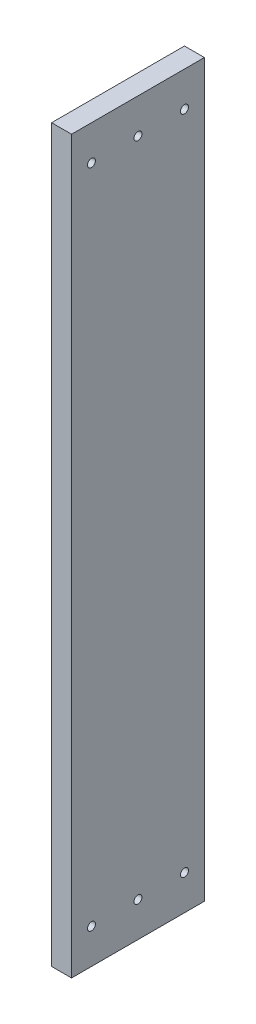
ISO-10303-21;
HEADER;
FILE_DESCRIPTION(('STEP AP214'),'2;1');
FILE_NAME('part.step','',(''),(''),'','','');
FILE_SCHEMA(('AUTOMOTIVE_DESIGN { 1 0 10303 214 1 1 1 1 }'));
ENDSEC;
DATA;
#1=APPLICATION_CONTEXT('core data for automotive mechanical design processes');
#2=APPLICATION_PROTOCOL_DEFINITION('international standard','automotive_design',2000,#1);
#3=PRODUCT_CONTEXT('',#1,'mechanical');
#4=PRODUCT('Part','Part','',(#3));
#5=PRODUCT_RELATED_PRODUCT_CATEGORY('part','',(#4));
#6=PRODUCT_DEFINITION_FORMATION('','',#4);
#7=PRODUCT_DEFINITION_CONTEXT('part definition',#1,'design');
#8=PRODUCT_DEFINITION('design','',#6,#7);
#9=PRODUCT_DEFINITION_SHAPE('','',#8);
#10=(LENGTH_UNIT() NAMED_UNIT(*) SI_UNIT(.MILLI.,.METRE.));
#11=(NAMED_UNIT(*) PLANE_ANGLE_UNIT() SI_UNIT($,.RADIAN.));
#12=(NAMED_UNIT(*) SI_UNIT($,.STERADIAN.) SOLID_ANGLE_UNIT());
#13=UNCERTAINTY_MEASURE_WITH_UNIT(LENGTH_MEASURE(1.E-05),#10,'distance_accuracy_value','');
#14=(GEOMETRIC_REPRESENTATION_CONTEXT(3) GLOBAL_UNCERTAINTY_ASSIGNED_CONTEXT((#13)) GLOBAL_UNIT_ASSIGNED_CONTEXT((#10,
#11,#12)) REPRESENTATION_CONTEXT('',''));
#15=CARTESIAN_POINT('',(0.,0.,0.));
#16=DIRECTION('',(0.,0.,1.));
#17=DIRECTION('',(1.,0.,0.));
#18=AXIS2_PLACEMENT_3D('',#15,#16,#17);
#19=CARTESIAN_POINT('',(0.,698.5,0.));
#20=DIRECTION('',(1.,0.,0.));
#21=DIRECTION('',(0.,0.,-1.));
#22=AXIS2_PLACEMENT_3D('',#19,#20,#21);
#23=PLANE('',#22);
#24=CARTESIAN_POINT('',(0.,33.274,-107.95));
#25=DIRECTION('',(1.,0.,0.));
#26=DIRECTION('',(0.,0.,-1.));
#27=AXIS2_PLACEMENT_3D('',#24,#25,#26);
#28=CIRCLE('',#27,3.81000000000002);
#29=CARTESIAN_POINT('',(0.,33.274,-111.76));
#30=VERTEX_POINT('',#29);
#31=EDGE_CURVE('E98',#30,#30,#28,.T.);
#32=ORIENTED_EDGE('',*,*,#31,.T.);
#33=EDGE_LOOP('',(#32));
#34=FACE_BOUND('',#33,.T.);
#35=CARTESIAN_POINT('',(0.,33.274,-63.5000000000001));
#36=DIRECTION('',(1.,0.,0.));
#37=DIRECTION('',(0.,0.,-1.));
#38=AXIS2_PLACEMENT_3D('',#35,#36,#37);
#39=CIRCLE('',#38,3.81000000000003);
#40=CARTESIAN_POINT('',(0.,33.274,-67.3100000000001));
#41=VERTEX_POINT('',#40);
#42=EDGE_CURVE('E111',#41,#41,#39,.T.);
#43=ORIENTED_EDGE('',*,*,#42,.T.);
#44=EDGE_LOOP('',(#43));
#45=FACE_BOUND('',#44,.T.);
#46=CARTESIAN_POINT('',(0.,33.274,-19.0500000000001));
#47=DIRECTION('',(1.,0.,0.));
#48=DIRECTION('',(0.,0.,-1.));
#49=AXIS2_PLACEMENT_3D('',#46,#47,#48);
#50=CIRCLE('',#49,3.81000000000003);
#51=CARTESIAN_POINT('',(0.,33.274,-22.8600000000001));
#52=VERTEX_POINT('',#51);
#53=EDGE_CURVE('E114',#52,#52,#50,.T.);
#54=ORIENTED_EDGE('',*,*,#53,.T.);
#55=EDGE_LOOP('',(#54));
#56=FACE_BOUND('',#55,.T.);
#57=CARTESIAN_POINT('',(0.,665.226,-19.05));
#58=DIRECTION('',(1.,0.,0.));
#59=DIRECTION('',(0.,0.,-1.));
#60=AXIS2_PLACEMENT_3D('',#57,#58,#59);
#61=CIRCLE('',#60,3.8100000000001);
#62=CARTESIAN_POINT('',(0.,665.226,-22.8600000000001));
#63=VERTEX_POINT('',#62);
#64=EDGE_CURVE('E117',#63,#63,#61,.T.);
#65=ORIENTED_EDGE('',*,*,#64,.T.);
#66=EDGE_LOOP('',(#65));
#67=FACE_BOUND('',#66,.T.);
#68=CARTESIAN_POINT('',(0.,665.226,-63.5));
#69=DIRECTION('',(1.,0.,0.));
#70=DIRECTION('',(0.,0.,-1.));
#71=AXIS2_PLACEMENT_3D('',#68,#69,#70);
#72=CIRCLE('',#71,3.81000000000005);
#73=CARTESIAN_POINT('',(0.,665.226,-67.31));
#74=VERTEX_POINT('',#73);
#75=EDGE_CURVE('E120',#74,#74,#72,.T.);
#76=ORIENTED_EDGE('',*,*,#75,.T.);
#77=EDGE_LOOP('',(#76));
#78=FACE_BOUND('',#77,.T.);
#79=CARTESIAN_POINT('',(0.,665.226,-107.95));
#80=DIRECTION('',(1.,0.,0.));
#81=DIRECTION('',(0.,0.,-1.));
#82=AXIS2_PLACEMENT_3D('',#79,#80,#81);
#83=CIRCLE('',#82,3.81000000000003);
#84=CARTESIAN_POINT('',(0.,665.226,-111.76));
#85=VERTEX_POINT('',#84);
#86=EDGE_CURVE('E123',#85,#85,#83,.T.);
#87=ORIENTED_EDGE('',*,*,#86,.T.);
#88=EDGE_LOOP('',(#87));
#89=FACE_BOUND('',#88,.T.);
#90=DIRECTION('',(0.,0.,1.));
#91=VECTOR('',#90,1.);
#92=CARTESIAN_POINT('',(0.,0.,0.));
#93=LINE('',#92,#91);
#94=CARTESIAN_POINT('',(0.,0.,-127.));
#95=VERTEX_POINT('',#94);
#96=CARTESIAN_POINT('',(0.,0.,0.));
#97=VERTEX_POINT('',#96);
#98=EDGE_CURVE('E95',#95,#97,#93,.T.);
#99=ORIENTED_EDGE('',*,*,#98,.T.);
#100=DIRECTION('',(0.,-1.,0.));
#101=VECTOR('',#100,1.);
#102=CARTESIAN_POINT('',(0.,698.5,0.));
#103=LINE('',#102,#101);
#104=CARTESIAN_POINT('',(0.,698.5,0.));
#105=VERTEX_POINT('',#104);
#106=EDGE_CURVE('E11',#105,#97,#103,.T.);
#107=ORIENTED_EDGE('',*,*,#106,.F.);
#108=DIRECTION('',(0.,0.,1.));
#109=VECTOR('',#108,1.);
#110=CARTESIAN_POINT('',(0.,698.5,0.));
#111=LINE('',#110,#109);
#112=CARTESIAN_POINT('',(0.,698.5,-127.));
#113=VERTEX_POINT('',#112);
#114=EDGE_CURVE('E83',#113,#105,#111,.T.);
#115=ORIENTED_EDGE('',*,*,#114,.F.);
#116=DIRECTION('',(0.,-1.,0.));
#117=VECTOR('',#116,1.);
#118=CARTESIAN_POINT('',(0.,698.5,-127.));
#119=LINE('',#118,#117);
#120=EDGE_CURVE('E91',#113,#95,#119,.T.);
#121=ORIENTED_EDGE('',*,*,#120,.T.);
#122=EDGE_LOOP('',(#99,#107,#115,#121));
#123=FACE_BOUND('',#122,.T.);
#124=ADVANCED_FACE('F32',(#34,#45,#56,#67,#78,#89,#123),#23,.F.);
#125=CARTESIAN_POINT('',(0.,698.5,0.));
#126=DIRECTION('',(0.,0.,-1.));
#127=DIRECTION('',(-1.,0.,0.));
#128=AXIS2_PLACEMENT_3D('',#125,#126,#127);
#129=PLANE('',#128);
#130=DIRECTION('',(1.,0.,0.));
#131=VECTOR('',#130,1.);
#132=CARTESIAN_POINT('',(0.,0.,0.));
#133=LINE('',#132,#131);
#134=CARTESIAN_POINT('',(19.05,0.,0.));
#135=VERTEX_POINT('',#134);
#136=EDGE_CURVE('E87',#97,#135,#133,.T.);
#137=ORIENTED_EDGE('',*,*,#136,.T.);
#138=DIRECTION('',(0.,-1.,0.));
#139=VECTOR('',#138,1.);
#140=CARTESIAN_POINT('',(19.05,698.5,0.));
#141=LINE('',#140,#139);
#142=CARTESIAN_POINT('',(19.05,698.5,0.));
#143=VERTEX_POINT('',#142);
#144=EDGE_CURVE('E40',#143,#135,#141,.T.);
#145=ORIENTED_EDGE('',*,*,#144,.F.);
#146=DIRECTION('',(1.,0.,0.));
#147=VECTOR('',#146,1.);
#148=CARTESIAN_POINT('',(0.,698.5,0.));
#149=LINE('',#148,#147);
#150=EDGE_CURVE('E78',#105,#143,#149,.T.);
#151=ORIENTED_EDGE('',*,*,#150,.F.);
#152=ORIENTED_EDGE('',*,*,#106,.T.);
#153=EDGE_LOOP('',(#137,#145,#151,#152));
#154=FACE_BOUND('',#153,.T.);
#155=ADVANCED_FACE('F86',(#154),#129,.F.);
#156=CARTESIAN_POINT('',(19.05,698.5,0.));
#157=DIRECTION('',(-1.,0.,0.));
#158=DIRECTION('',(0.,0.,1.));
#159=AXIS2_PLACEMENT_3D('',#156,#157,#158);
#160=PLANE('',#159);
#161=CARTESIAN_POINT('',(19.05,33.274,-107.95));
#162=DIRECTION('',(1.,0.,0.));
#163=DIRECTION('',(0.,0.,1.));
#164=AXIS2_PLACEMENT_3D('',#161,#162,#163);
#165=CIRCLE('',#164,3.81000000000002);
#166=CARTESIAN_POINT('',(19.05,33.274,-104.14));
#167=VERTEX_POINT('',#166);
#168=EDGE_CURVE('E130',#167,#167,#165,.T.);
#169=ORIENTED_EDGE('',*,*,#168,.F.);
#170=EDGE_LOOP('',(#169));
#171=FACE_BOUND('',#170,.T.);
#172=CARTESIAN_POINT('',(19.05,33.274,-63.5000000000001));
#173=DIRECTION('',(1.,0.,0.));
#174=DIRECTION('',(0.,0.,1.));
#175=AXIS2_PLACEMENT_3D('',#172,#173,#174);
#176=CIRCLE('',#175,3.81000000000003);
#177=CARTESIAN_POINT('',(19.05,33.274,-59.6900000000001));
#178=VERTEX_POINT('',#177);
#179=EDGE_CURVE('E133',#178,#178,#176,.T.);
#180=ORIENTED_EDGE('',*,*,#179,.F.);
#181=EDGE_LOOP('',(#180));
#182=FACE_BOUND('',#181,.T.);
#183=CARTESIAN_POINT('',(19.05,33.274,-19.0500000000001));
#184=DIRECTION('',(1.,0.,0.));
#185=DIRECTION('',(0.,0.,1.));
#186=AXIS2_PLACEMENT_3D('',#183,#184,#185);
#187=CIRCLE('',#186,3.81000000000003);
#188=CARTESIAN_POINT('',(19.05,33.274,-15.2400000000001));
#189=VERTEX_POINT('',#188);
#190=EDGE_CURVE('E136',#189,#189,#187,.T.);
#191=ORIENTED_EDGE('',*,*,#190,.F.);
#192=EDGE_LOOP('',(#191));
#193=FACE_BOUND('',#192,.T.);
#194=CARTESIAN_POINT('',(19.05,665.226,-19.05));
#195=DIRECTION('',(1.,0.,0.));
#196=DIRECTION('',(0.,0.,-1.));
#197=AXIS2_PLACEMENT_3D('',#194,#195,#196);
#198=CIRCLE('',#197,3.8100000000001);
#199=CARTESIAN_POINT('',(19.05,665.226,-22.8600000000001));
#200=VERTEX_POINT('',#199);
#201=EDGE_CURVE('E139',#200,#200,#198,.T.);
#202=ORIENTED_EDGE('',*,*,#201,.F.);
#203=EDGE_LOOP('',(#202));
#204=FACE_BOUND('',#203,.T.);
#205=CARTESIAN_POINT('',(19.05,665.226,-63.5));
#206=DIRECTION('',(1.,0.,0.));
#207=DIRECTION('',(0.,0.,-1.));
#208=AXIS2_PLACEMENT_3D('',#205,#206,#207);
#209=CIRCLE('',#208,3.81000000000005);
#210=CARTESIAN_POINT('',(19.05,665.226,-67.31));
#211=VERTEX_POINT('',#210);
#212=EDGE_CURVE('E129',#211,#211,#209,.T.);
#213=ORIENTED_EDGE('',*,*,#212,.F.);
#214=EDGE_LOOP('',(#213));
#215=FACE_BOUND('',#214,.T.);
#216=CARTESIAN_POINT('',(19.05,665.226,-107.95));
#217=DIRECTION('',(1.,0.,0.));
#218=DIRECTION('',(0.,0.,-1.));
#219=AXIS2_PLACEMENT_3D('',#216,#217,#218);
#220=CIRCLE('',#219,3.81000000000003);
#221=CARTESIAN_POINT('',(19.05,665.226,-111.76));
#222=VERTEX_POINT('',#221);
#223=EDGE_CURVE('E126',#222,#222,#220,.T.);
#224=ORIENTED_EDGE('',*,*,#223,.F.);
#225=EDGE_LOOP('',(#224));
#226=FACE_BOUND('',#225,.T.);
#227=DIRECTION('',(0.,0.,-1.));
#228=VECTOR('',#227,1.);
#229=CARTESIAN_POINT('',(19.05,0.,0.));
#230=LINE('',#229,#228);
#231=CARTESIAN_POINT('',(19.05,0.,-127.));
#232=VERTEX_POINT('',#231);
#233=EDGE_CURVE('E65',#135,#232,#230,.T.);
#234=ORIENTED_EDGE('',*,*,#233,.T.);
#235=DIRECTION('',(0.,-1.,0.));
#236=VECTOR('',#235,1.);
#237=CARTESIAN_POINT('',(19.05,698.5,-127.));
#238=LINE('',#237,#236);
#239=CARTESIAN_POINT('',(19.05,698.5,-127.));
#240=VERTEX_POINT('',#239);
#241=EDGE_CURVE('E88',#240,#232,#238,.T.);
#242=ORIENTED_EDGE('',*,*,#241,.F.);
#243=DIRECTION('',(0.,0.,-1.));
#244=VECTOR('',#243,1.);
#245=CARTESIAN_POINT('',(19.05,698.5,0.));
#246=LINE('',#245,#244);
#247=EDGE_CURVE('E81',#143,#240,#246,.T.);
#248=ORIENTED_EDGE('',*,*,#247,.F.);
#249=ORIENTED_EDGE('',*,*,#144,.T.);
#250=EDGE_LOOP('',(#234,#242,#248,#249));
#251=FACE_BOUND('',#250,.T.);
#252=ADVANCED_FACE('F89',(#171,#182,#193,#204,#215,#226,#251),#160,.F.);
#253=CARTESIAN_POINT('',(0.,698.5,-127.));
#254=DIRECTION('',(0.,0.,1.));
#255=DIRECTION('',(1.,0.,0.));
#256=AXIS2_PLACEMENT_3D('',#253,#254,#255);
#257=PLANE('',#256);
#258=DIRECTION('',(-1.,0.,0.));
#259=VECTOR('',#258,1.);
#260=CARTESIAN_POINT('',(0.,0.,-127.));
#261=LINE('',#260,#259);
#262=EDGE_CURVE('E71',#232,#95,#261,.T.);
#263=ORIENTED_EDGE('',*,*,#262,.T.);
#264=ORIENTED_EDGE('',*,*,#120,.F.);
#265=DIRECTION('',(-1.,0.,0.));
#266=VECTOR('',#265,1.);
#267=CARTESIAN_POINT('',(0.,698.5,-127.));
#268=LINE('',#267,#266);
#269=EDGE_CURVE('E48',#240,#113,#268,.T.);
#270=ORIENTED_EDGE('',*,*,#269,.F.);
#271=ORIENTED_EDGE('',*,*,#241,.T.);
#272=EDGE_LOOP('',(#263,#264,#270,#271));
#273=FACE_BOUND('',#272,.T.);
#274=ADVANCED_FACE('F103',(#273),#257,.F.);
#275=CARTESIAN_POINT('',(0.,698.5,0.));
#276=DIRECTION('',(0.,-1.,0.));
#277=DIRECTION('',(0.,0.,-1.));
#278=AXIS2_PLACEMENT_3D('',#275,#276,#277);
#279=PLANE('',#278);
#280=ORIENTED_EDGE('',*,*,#114,.T.);
#281=ORIENTED_EDGE('',*,*,#150,.T.);
#282=ORIENTED_EDGE('',*,*,#247,.T.);
#283=ORIENTED_EDGE('',*,*,#269,.T.);
#284=EDGE_LOOP('',(#280,#281,#282,#283));
#285=FACE_BOUND('',#284,.T.);
#286=ADVANCED_FACE('F79',(#285),#279,.F.);
#287=CARTESIAN_POINT('',(0.,0.,0.));
#288=DIRECTION('',(0.,-1.,0.));
#289=DIRECTION('',(0.,0.,-1.));
#290=AXIS2_PLACEMENT_3D('',#287,#288,#289);
#291=PLANE('',#290);
#292=ORIENTED_EDGE('',*,*,#98,.F.);
#293=ORIENTED_EDGE('',*,*,#262,.F.);
#294=ORIENTED_EDGE('',*,*,#233,.F.);
#295=ORIENTED_EDGE('',*,*,#136,.F.);
#296=EDGE_LOOP('',(#292,#293,#294,#295));
#297=FACE_BOUND('',#296,.T.);
#298=ADVANCED_FACE('F106',(#297),#291,.T.);
#299=CARTESIAN_POINT('',(-48.7679999999999,665.226,-107.95));
#300=DIRECTION('',(1.,0.,0.));
#301=DIRECTION('',(0.,0.,-1.));
#302=AXIS2_PLACEMENT_3D('',#299,#300,#301);
#303=CYLINDRICAL_SURFACE('',#302,3.81000000000003);
#304=ORIENTED_EDGE('',*,*,#223,.T.);
#305=EDGE_LOOP('',(#304));
#306=FACE_BOUND('',#305,.T.);
#307=ORIENTED_EDGE('',*,*,#86,.F.);
#308=EDGE_LOOP('',(#307));
#309=FACE_BOUND('',#308,.T.);
#310=ADVANCED_FACE('F154',(#306,#309),#303,.F.);
#311=CARTESIAN_POINT('',(-48.7679999999999,665.226,-63.5));
#312=DIRECTION('',(1.,0.,0.));
#313=DIRECTION('',(0.,0.,-1.));
#314=AXIS2_PLACEMENT_3D('',#311,#312,#313);
#315=CYLINDRICAL_SURFACE('',#314,3.81000000000005);
#316=ORIENTED_EDGE('',*,*,#212,.T.);
#317=EDGE_LOOP('',(#316));
#318=FACE_BOUND('',#317,.T.);
#319=ORIENTED_EDGE('',*,*,#75,.F.);
#320=EDGE_LOOP('',(#319));
#321=FACE_BOUND('',#320,.T.);
#322=ADVANCED_FACE('F145',(#318,#321),#315,.F.);
#323=CARTESIAN_POINT('',(-48.7679999999999,665.226,-19.05));
#324=DIRECTION('',(1.,0.,0.));
#325=DIRECTION('',(0.,0.,-1.));
#326=AXIS2_PLACEMENT_3D('',#323,#324,#325);
#327=CYLINDRICAL_SURFACE('',#326,3.8100000000001);
#328=ORIENTED_EDGE('',*,*,#201,.T.);
#329=EDGE_LOOP('',(#328));
#330=FACE_BOUND('',#329,.T.);
#331=ORIENTED_EDGE('',*,*,#64,.F.);
#332=EDGE_LOOP('',(#331));
#333=FACE_BOUND('',#332,.T.);
#334=ADVANCED_FACE('F175',(#330,#333),#327,.F.);
#335=CARTESIAN_POINT('',(-48.7679999999999,33.274,-19.0500000000001));
#336=DIRECTION('',(1.,0.,0.));
#337=DIRECTION('',(0.,0.,-1.));
#338=AXIS2_PLACEMENT_3D('',#335,#336,#337);
#339=CYLINDRICAL_SURFACE('',#338,3.81000000000003);
#340=ORIENTED_EDGE('',*,*,#190,.T.);
#341=EDGE_LOOP('',(#340));
#342=FACE_BOUND('',#341,.T.);
#343=ORIENTED_EDGE('',*,*,#53,.F.);
#344=EDGE_LOOP('',(#343));
#345=FACE_BOUND('',#344,.T.);
#346=ADVANCED_FACE('F180',(#342,#345),#339,.F.);
#347=CARTESIAN_POINT('',(-48.7679999999999,33.274,-63.5000000000001));
#348=DIRECTION('',(1.,0.,0.));
#349=DIRECTION('',(0.,0.,-1.));
#350=AXIS2_PLACEMENT_3D('',#347,#348,#349);
#351=CYLINDRICAL_SURFACE('',#350,3.81000000000003);
#352=ORIENTED_EDGE('',*,*,#179,.T.);
#353=EDGE_LOOP('',(#352));
#354=FACE_BOUND('',#353,.T.);
#355=ORIENTED_EDGE('',*,*,#42,.F.);
#356=EDGE_LOOP('',(#355));
#357=FACE_BOUND('',#356,.T.);
#358=ADVANCED_FACE('F186',(#354,#357),#351,.F.);
#359=CARTESIAN_POINT('',(-48.7679999999999,33.274,-107.95));
#360=DIRECTION('',(1.,0.,0.));
#361=DIRECTION('',(0.,0.,-1.));
#362=AXIS2_PLACEMENT_3D('',#359,#360,#361);
#363=CYLINDRICAL_SURFACE('',#362,3.81000000000002);
#364=ORIENTED_EDGE('',*,*,#168,.T.);
#365=EDGE_LOOP('',(#364));
#366=FACE_BOUND('',#365,.T.);
#367=ORIENTED_EDGE('',*,*,#31,.F.);
#368=EDGE_LOOP('',(#367));
#369=FACE_BOUND('',#368,.T.);
#370=ADVANCED_FACE('F190',(#366,#369),#363,.F.);
#371=CLOSED_SHELL('',(#124,#155,#252,#274,#286,#298,#310,#322,#334,#346,#358,#370));
#372=MANIFOLD_SOLID_BREP('B2',#371);
#373=ADVANCED_BREP_SHAPE_REPRESENTATION('',(#18,#372),#14);
#374=SHAPE_DEFINITION_REPRESENTATION(#9,#373);
ENDSEC;
END-ISO-10303-21;
